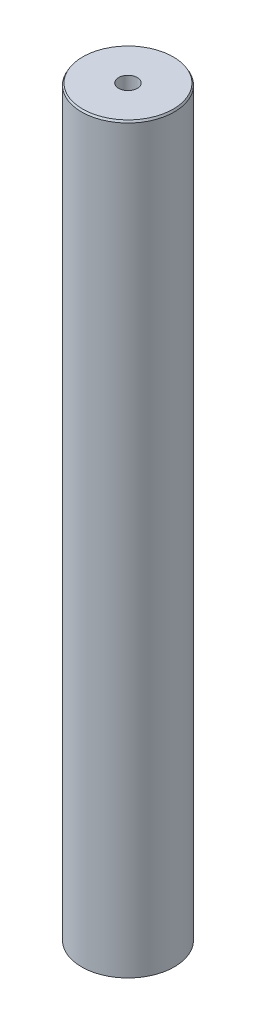
ISO-10303-21;
HEADER;
FILE_DESCRIPTION(('STEP AP214'),'2;1');
FILE_NAME('part.step','',(''),(''),'','','');
FILE_SCHEMA(('AUTOMOTIVE_DESIGN { 1 0 10303 214 1 1 1 1 }'));
ENDSEC;
DATA;
#1=APPLICATION_CONTEXT('core data for automotive mechanical design processes');
#2=APPLICATION_PROTOCOL_DEFINITION('international standard','automotive_design',2000,#1);
#3=PRODUCT_CONTEXT('',#1,'mechanical');
#4=PRODUCT('Part','Part','',(#3));
#5=PRODUCT_RELATED_PRODUCT_CATEGORY('part','',(#4));
#6=PRODUCT_DEFINITION_FORMATION('','',#4);
#7=PRODUCT_DEFINITION_CONTEXT('part definition',#1,'design');
#8=PRODUCT_DEFINITION('design','',#6,#7);
#9=PRODUCT_DEFINITION_SHAPE('','',#8);
#10=(LENGTH_UNIT() NAMED_UNIT(*) SI_UNIT(.MILLI.,.METRE.));
#11=(NAMED_UNIT(*) PLANE_ANGLE_UNIT() SI_UNIT($,.RADIAN.));
#12=(NAMED_UNIT(*) SI_UNIT($,.STERADIAN.) SOLID_ANGLE_UNIT());
#13=UNCERTAINTY_MEASURE_WITH_UNIT(LENGTH_MEASURE(1.E-05),#10,'distance_accuracy_value','');
#14=(GEOMETRIC_REPRESENTATION_CONTEXT(3) GLOBAL_UNCERTAINTY_ASSIGNED_CONTEXT((#13)) GLOBAL_UNIT_ASSIGNED_CONTEXT((#10,
#11,#12)) REPRESENTATION_CONTEXT('',''));
#15=CARTESIAN_POINT('',(0.,0.,0.));
#16=DIRECTION('',(0.,0.,1.));
#17=DIRECTION('',(1.,0.,0.));
#18=AXIS2_PLACEMENT_3D('',#15,#16,#17);
#19=CARTESIAN_POINT('',(0.,80.1438957185827,0.));
#20=DIRECTION('',(0.,-1.,0.));
#21=DIRECTION('',(0.,0.,-1.));
#22=AXIS2_PLACEMENT_3D('',#19,#20,#21);
#23=CYLINDRICAL_SURFACE('',#22,5.);
#24=CARTESIAN_POINT('',(0.,79.9366690602286,0.));
#25=DIRECTION('',(0.,1.,0.));
#26=DIRECTION('',(0.,0.,1.));
#27=AXIS2_PLACEMENT_3D('',#24,#25,#26);
#28=CIRCLE('',#27,5.);
#29=CARTESIAN_POINT('',(0.,79.9366690602286,5.));
#30=VERTEX_POINT('',#29);
#31=EDGE_CURVE('E50',#30,#30,#28,.F.);
#32=ORIENTED_EDGE('',*,*,#31,.T.);
#33=EDGE_LOOP('',(#32));
#34=FACE_BOUND('',#33,.T.);
#35=CARTESIAN_POINT('',(0.,0.11964236698403,0.));
#36=DIRECTION('',(0.,1.,0.));
#37=DIRECTION('',(0.,0.,1.));
#38=AXIS2_PLACEMENT_3D('',#35,#36,#37);
#39=CIRCLE('',#38,5.);
#40=CARTESIAN_POINT('',(0.,0.11964236698403,5.));
#41=VERTEX_POINT('',#40);
#42=EDGE_CURVE('E51',#41,#41,#39,.T.);
#43=ORIENTED_EDGE('',*,*,#42,.T.);
#44=EDGE_LOOP('',(#43));
#45=FACE_BOUND('',#44,.T.);
#46=ADVANCED_FACE('F39',(#34,#45),#23,.T.);
#47=CARTESIAN_POINT('',(0.,80.1438957185827,0.));
#48=DIRECTION('',(0.,1.,0.));
#49=DIRECTION('',(0.,0.,1.));
#50=AXIS2_PLACEMENT_3D('',#47,#48,#49);
#51=PLANE('',#50);
#52=CARTESIAN_POINT('',(0.,80.1438957185827,0.));
#53=DIRECTION('',(0.,1.,0.));
#54=DIRECTION('',(0.,0.,1.));
#55=AXIS2_PLACEMENT_3D('',#52,#53,#54);
#56=CIRCLE('',#55,4.88035763301597);
#57=CARTESIAN_POINT('',(0.,80.1438957185827,4.88035763301597));
#58=VERTEX_POINT('',#57);
#59=EDGE_CURVE('E54',#58,#58,#56,.T.);
#60=ORIENTED_EDGE('',*,*,#59,.T.);
#61=EDGE_LOOP('',(#60));
#62=FACE_BOUND('',#61,.T.);
#63=CARTESIAN_POINT('',(0.,80.1438957185827,0.));
#64=DIRECTION('',(0.,1.,0.));
#65=DIRECTION('',(0.,0.,1.));
#66=AXIS2_PLACEMENT_3D('',#63,#64,#65);
#67=CIRCLE('',#66,1.00990164040733);
#68=CARTESIAN_POINT('',(0.,80.1438957185827,1.00990164040733));
#69=VERTEX_POINT('',#68);
#70=EDGE_CURVE('E58',#69,#69,#67,.T.);
#71=ORIENTED_EDGE('',*,*,#70,.F.);
#72=EDGE_LOOP('',(#71));
#73=FACE_BOUND('',#72,.T.);
#74=ADVANCED_FACE('F69',(#62,#73),#51,.T.);
#75=CARTESIAN_POINT('',(0.,0.,0.));
#76=DIRECTION('',(0.,1.,0.));
#77=DIRECTION('',(0.,0.,1.));
#78=AXIS2_PLACEMENT_3D('',#75,#76,#77);
#79=PLANE('',#78);
#80=CARTESIAN_POINT('',(0.,0.,0.));
#81=DIRECTION('',(0.,1.,0.));
#82=DIRECTION('',(0.,0.,1.));
#83=AXIS2_PLACEMENT_3D('',#80,#81,#82);
#84=CIRCLE('',#83,4.79277334164588);
#85=CARTESIAN_POINT('',(0.,0.,4.79277334164588));
#86=VERTEX_POINT('',#85);
#87=EDGE_CURVE('E10',#86,#86,#84,.F.);
#88=ORIENTED_EDGE('',*,*,#87,.T.);
#89=EDGE_LOOP('',(#88));
#90=FACE_BOUND('',#89,.T.);
#91=CARTESIAN_POINT('',(0.,0.,0.));
#92=DIRECTION('',(0.,1.,0.));
#93=DIRECTION('',(0.,0.,1.));
#94=AXIS2_PLACEMENT_3D('',#91,#92,#93);
#95=CIRCLE('',#94,1.00990164040733);
#96=CARTESIAN_POINT('',(0.,0.,1.00990164040733));
#97=VERTEX_POINT('',#96);
#98=EDGE_CURVE('E63',#97,#97,#95,.T.);
#99=ORIENTED_EDGE('',*,*,#98,.T.);
#100=EDGE_LOOP('',(#99));
#101=FACE_BOUND('',#100,.T.);
#102=ADVANCED_FACE('F75',(#90,#101),#79,.F.);
#103=CARTESIAN_POINT('',(0.,80.1438957185827,0.));
#104=DIRECTION('',(0.,-1.,0.));
#105=DIRECTION('',(0.,0.,-1.));
#106=AXIS2_PLACEMENT_3D('',#103,#104,#105);
#107=CYLINDRICAL_SURFACE('',#106,1.00990164040733);
#108=ORIENTED_EDGE('',*,*,#70,.T.);
#109=EDGE_LOOP('',(#108));
#110=FACE_BOUND('',#109,.T.);
#111=ORIENTED_EDGE('',*,*,#98,.F.);
#112=EDGE_LOOP('',(#111));
#113=FACE_BOUND('',#112,.T.);
#114=ADVANCED_FACE('F70',(#110,#113),#107,.F.);
#115=CARTESIAN_POINT('',(0.,80.1438957185827,0.));
#116=DIRECTION('',(0.,-1.,0.));
#117=DIRECTION('',(0.,0.,-1.));
#118=AXIS2_PLACEMENT_3D('',#115,#116,#117);
#119=CONICAL_SURFACE('',#118,4.88035763301597,0.523598775598313);
#120=ORIENTED_EDGE('',*,*,#31,.F.);
#121=EDGE_LOOP('',(#120));
#122=FACE_BOUND('',#121,.T.);
#123=ORIENTED_EDGE('',*,*,#59,.F.);
#124=EDGE_LOOP('',(#123));
#125=FACE_BOUND('',#124,.T.);
#126=ADVANCED_FACE('F81',(#122,#125),#119,.T.);
#127=CARTESIAN_POINT('',(0.,0.11964236698403,0.));
#128=DIRECTION('',(0.,1.,0.));
#129=DIRECTION('',(0.,0.,1.));
#130=AXIS2_PLACEMENT_3D('',#127,#128,#129);
#131=CONICAL_SURFACE('',#130,5.,1.04719755119656);
#132=CARTESIAN_POINT('',(0.,0.,4.79277334164588));
#133=CARTESIAN_POINT('',(0.,0.00124627465608371,4.7949319526704));
#134=CARTESIAN_POINT('',(0.,0.00249254931216731,4.79709056369492));
#135=CARTESIAN_POINT('',(0.,0.00498509862433451,4.80140778574397));
#136=CARTESIAN_POINT('',(0.,0.00623137328041811,4.80356639676849));
#137=CARTESIAN_POINT('',(0.,0.00872392259258544,4.80788361881753));
#138=CARTESIAN_POINT('',(0.,0.00997019724866917,4.81004222984205));
#139=CARTESIAN_POINT('',(0.,0.0124627465608365,4.8143594518911));
#140=CARTESIAN_POINT('',(0.,0.0137090212169201,4.81651806291562));
#141=CARTESIAN_POINT('',(0.,0.0162015705290873,4.82083528496467));
#142=CARTESIAN_POINT('',(0.,0.017447845185171,4.82299389598919));
#143=CARTESIAN_POINT('',(0.,0.0199403944973383,4.82731111803823));
#144=CARTESIAN_POINT('',(0.,0.0211866691534219,4.82946972906275));
#145=CARTESIAN_POINT('',(0.,0.0236792184655892,4.8337869511118));
#146=CARTESIAN_POINT('',(0.,0.0249254931216728,4.83594556213632));
#147=CARTESIAN_POINT('',(0.,0.0274180424338401,4.84026278418536));
#148=CARTESIAN_POINT('',(0.,0.0286643170899238,4.84242139520989));
#149=CARTESIAN_POINT('',(0.,0.031156866402091,4.84673861725893));
#150=CARTESIAN_POINT('',(0.,0.0324031410581746,4.84889722828345));
#151=CARTESIAN_POINT('',(0.,0.0348956903703419,4.8532144503325));
#152=CARTESIAN_POINT('',(0.,0.0361419650264257,4.85537306135702));
#153=CARTESIAN_POINT('',(0.,0.038634514338593,4.85969028340606));
#154=CARTESIAN_POINT('',(0.,0.0398807889946765,4.86184889443059));
#155=CARTESIAN_POINT('',(0.,0.0423733383068438,4.86616611647963));
#156=CARTESIAN_POINT('',(0.,0.0436196129629275,4.86832472750415));
#157=CARTESIAN_POINT('',(0.,0.0461121622750948,4.8726419495532));
#158=CARTESIAN_POINT('',(0.,0.0473584369311784,4.87480056057772));
#159=CARTESIAN_POINT('',(0.,0.0498509862433457,4.87911778262676));
#160=CARTESIAN_POINT('',(0.,0.0510972608994293,4.88127639365128));
#161=CARTESIAN_POINT('',(0.,0.0535898102115966,4.88559361570033));
#162=CARTESIAN_POINT('',(0.,0.0548360848676802,4.88775222672485));
#163=CARTESIAN_POINT('',(0.,0.0573286341798475,4.8920694487739));
#164=CARTESIAN_POINT('',(0.,0.0585749088359312,4.89422805979842));
#165=CARTESIAN_POINT('',(0.,0.0610674581480985,4.89854528184746));
#166=CARTESIAN_POINT('',(0.,0.0623137328041821,4.90070389287198));
#167=CARTESIAN_POINT('',(0.,0.0648062821163494,4.90502111492103));
#168=CARTESIAN_POINT('',(0.,0.066052556772433,4.90717972594555));
#169=CARTESIAN_POINT('',(0.,0.0685451060846003,4.91149694799459));
#170=CARTESIAN_POINT('',(0.,0.069791380740684,4.91365555901912));
#171=CARTESIAN_POINT('',(0.,0.0722839300528512,4.91797278106816));
#172=CARTESIAN_POINT('',(0.,0.0735302047089349,4.92013139209268));
#173=CARTESIAN_POINT('',(0.,0.0760227540211022,4.92444861414173));
#174=CARTESIAN_POINT('',(0.,0.0772690286771858,4.92660722516625));
#175=CARTESIAN_POINT('',(0.,0.0797615779893531,4.93092444721529));
#176=CARTESIAN_POINT('',(0.,0.0810078526454367,4.93308305823982));
#177=CARTESIAN_POINT('',(0.,0.083500401957604,4.93740028028886));
#178=CARTESIAN_POINT('',(0.,0.0847466766136877,4.93955889131338));
#179=CARTESIAN_POINT('',(0.,0.087239225925855,4.94387611336243));
#180=CARTESIAN_POINT('',(0.,0.0884855005819386,4.94603472438695));
#181=CARTESIAN_POINT('',(0.,0.0909780498941059,4.95035194643599));
#182=CARTESIAN_POINT('',(0.,0.0922243245501895,4.95251055746051));
#183=CARTESIAN_POINT('',(0.,0.0947168738623568,4.95682777950956));
#184=CARTESIAN_POINT('',(0.,0.0959631485184404,4.95898639053408));
#185=CARTESIAN_POINT('',(0.,0.0984556978306077,4.96330361258312));
#186=CARTESIAN_POINT('',(0.,0.0997019724866914,4.96546222360765));
#187=CARTESIAN_POINT('',(0.,0.102194521798859,4.96977944565669));
#188=CARTESIAN_POINT('',(0.,0.103440796454942,4.97193805668121));
#189=CARTESIAN_POINT('',(0.,0.10593334576711,4.97625527873026));
#190=CARTESIAN_POINT('',(0.,0.107179620423193,4.97841388975478));
#191=CARTESIAN_POINT('',(0.,0.109672169735361,4.98273111180382));
#192=CARTESIAN_POINT('',(0.,0.110918444391444,4.98488972282835));
#193=CARTESIAN_POINT('',(0.,0.113410993703611,4.98920694487739));
#194=CARTESIAN_POINT('',(0.,0.114657268359695,4.99136555590191));
#195=CARTESIAN_POINT('',(0.,0.117149817671862,4.99568277795096));
#196=CARTESIAN_POINT('',(0.,0.118396092327946,4.99784138897548));
#197=CARTESIAN_POINT('',(0.,0.11964236698403,5.));
#198=B_SPLINE_CURVE_WITH_KNOTS('',3,(#132,#133,#134,#135,#136,#137,#138,#139,#140,#141,#142,
#143,#144,#145,#146,#147,#148,#149,#150,#151,#152,#153,#154,#155,#156,#157,#158,#159,#160,#161,
#162,#163,#164,#165,#166,#167,#168,#169,#170,#171,#172,#173,#174,#175,#176,#177,#178,#179,#180,
#181,#182,#183,#184,#185,#186,#187,#188,#189,#190,#191,#192,#193,#194,#195,#196,#197),
.UNSPECIFIED.,.F.,.F.,(4,2,2,2,2,2,2,2,2,2,2,2,2,2,2,2,2,2,2,2,2,2,2,2,2,2,2,2,2,2,2,2,4),(0.,
0.00747764793650146,0.0149552958730029,0.0224329438095036,0.0299105917460051,0.0373882396825065,
0.044865887619008,0.0523435355555095,0.0598211834920109,0.0672988314285124,0.0747764793650131,
0.0822541273015146,0.089731775238016,0.0972094231745175,0.104687071111019,0.11216471904752,
0.119642366984021,0.127120014920523,0.134597662857024,0.142075310793526,0.149552958730027,
0.157030606666528,0.16450825460303,0.171985902539531,0.179463550476032,0.186941198412534,
0.194418846349035,0.201896494285537,0.209374142222038,0.216851790158539,0.22432943809504,
0.231807086031542,0.239284733968043),.UNSPECIFIED.);
#199=EDGE_CURVE('BSEAM45',#86,#41,#198,.T.);
#200=ORIENTED_EDGE('',*,*,#87,.F.);
#201=ORIENTED_EDGE('',*,*,#42,.F.);
#202=ORIENTED_EDGE('',*,*,#199,.T.);
#203=ORIENTED_EDGE('',*,*,#199,.F.);
#204=EDGE_LOOP('',(#200,#202,#201,#203));
#205=FACE_BOUND('',#204,.T.);
#206=ADVANCED_FACE('F45',(#205),#131,.T.);
#207=CLOSED_SHELL('',(#46,#74,#102,#114,#126,#206));
#208=MANIFOLD_SOLID_BREP('B2',#207);
#209=ADVANCED_BREP_SHAPE_REPRESENTATION('',(#18,#208),#14);
#210=SHAPE_DEFINITION_REPRESENTATION(#9,#209);
ENDSEC;
END-ISO-10303-21;
